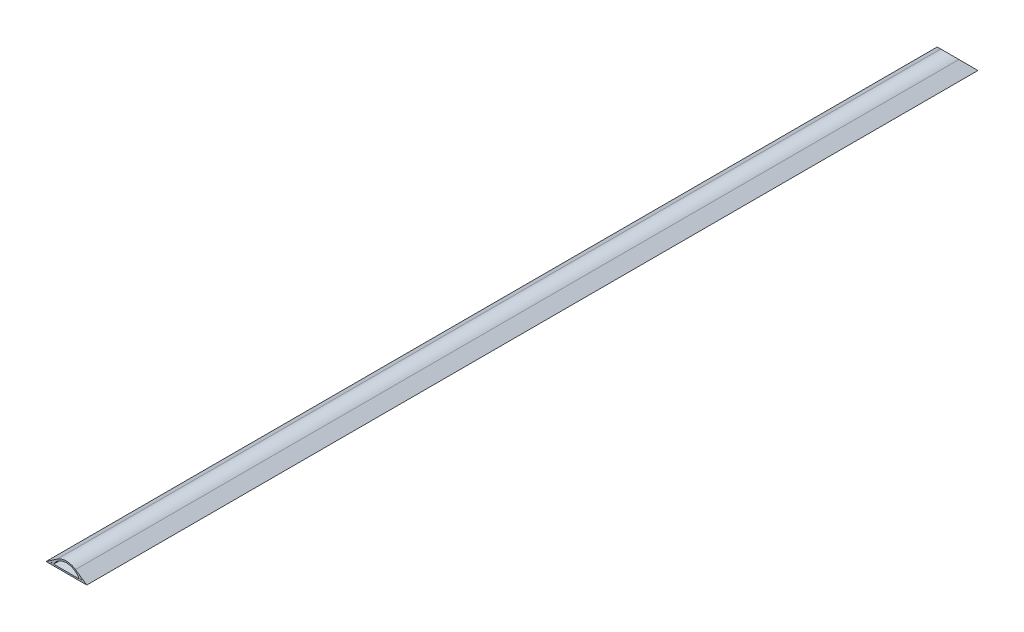
ISO-10303-21;
HEADER;
FILE_DESCRIPTION(('STEP AP214'),'2;1');
FILE_NAME('part.step','',(''),(''),'','','');
FILE_SCHEMA(('AUTOMOTIVE_DESIGN { 1 0 10303 214 1 1 1 1 }'));
ENDSEC;
DATA;
#1=APPLICATION_CONTEXT('core data for automotive mechanical design processes');
#2=APPLICATION_PROTOCOL_DEFINITION('international standard','automotive_design',2000,#1);
#3=PRODUCT_CONTEXT('',#1,'mechanical');
#4=PRODUCT('Part','Part','',(#3));
#5=PRODUCT_RELATED_PRODUCT_CATEGORY('part','',(#4));
#6=PRODUCT_DEFINITION_FORMATION('','',#4);
#7=PRODUCT_DEFINITION_CONTEXT('part definition',#1,'design');
#8=PRODUCT_DEFINITION('design','',#6,#7);
#9=PRODUCT_DEFINITION_SHAPE('','',#8);
#10=(LENGTH_UNIT() NAMED_UNIT(*) SI_UNIT(.MILLI.,.METRE.));
#11=(NAMED_UNIT(*) PLANE_ANGLE_UNIT() SI_UNIT($,.RADIAN.));
#12=(NAMED_UNIT(*) SI_UNIT($,.STERADIAN.) SOLID_ANGLE_UNIT());
#13=UNCERTAINTY_MEASURE_WITH_UNIT(LENGTH_MEASURE(1.E-05),#10,'distance_accuracy_value','');
#14=(GEOMETRIC_REPRESENTATION_CONTEXT(3) GLOBAL_UNCERTAINTY_ASSIGNED_CONTEXT((#13)) GLOBAL_UNIT_ASSIGNED_CONTEXT((#10,
#11,#12)) REPRESENTATION_CONTEXT('',''));
#15=CARTESIAN_POINT('',(0.,0.,0.));
#16=DIRECTION('',(0.,0.,1.));
#17=DIRECTION('',(1.,0.,0.));
#18=AXIS2_PLACEMENT_3D('',#15,#16,#17);
#19=CARTESIAN_POINT('',(34.29,-9.25285714285715,1498.6));
#20=DIRECTION('',(0.,0.,-1.));
#21=DIRECTION('',(-1.,0.,0.));
#22=AXIS2_PLACEMENT_3D('',#19,#20,#21);
#23=CYLINDRICAL_SURFACE('',#22,27.0328571428572);
#24=CARTESIAN_POINT('',(34.29,-9.25285714285715,-9.25285714285695));
#25=DIRECTION('',(0.,0.707106781186544,-0.707106781186551));
#26=DIRECTION('',(0.,-0.707106781186551,-0.707106781186544));
#27=AXIS2_PLACEMENT_3D('',#24,#25,#26);
#28=ELLIPSE('',#27,38.2302332011228,27.0328571428572);
#29=CARTESIAN_POINT('',(18.9926798567758,13.0354214300123,13.0354214300124));
#30=VERTEX_POINT('',#29);
#31=CARTESIAN_POINT('',(49.5873201432243,13.0354214300122,13.0354214300127));
#32=VERTEX_POINT('',#31);
#33=EDGE_CURVE('E54',#30,#32,#28,.T.);
#34=ORIENTED_EDGE('',*,*,#33,.F.);
#35=DIRECTION('',(0.,0.,-1.));
#36=VECTOR('',#35,1.);
#37=CARTESIAN_POINT('',(18.9926798567758,13.0354214300123,1498.6));
#38=LINE('',#37,#36);
#39=CARTESIAN_POINT('',(18.9926798567758,13.0354214300123,1498.6));
#40=VERTEX_POINT('',#39);
#41=EDGE_CURVE('E47',#40,#30,#38,.T.);
#42=ORIENTED_EDGE('',*,*,#41,.F.);
#43=CARTESIAN_POINT('',(34.29,-9.25285714285715,1498.6));
#44=DIRECTION('',(0.,0.,1.));
#45=DIRECTION('',(1.,0.,0.));
#46=AXIS2_PLACEMENT_3D('',#43,#44,#45);
#47=CIRCLE('',#46,27.0328571428572);
#48=CARTESIAN_POINT('',(49.5873201432242,13.0354214300123,1498.6));
#49=VERTEX_POINT('',#48);
#50=EDGE_CURVE('E157',#49,#40,#47,.T.);
#51=ORIENTED_EDGE('',*,*,#50,.F.);
#52=DIRECTION('',(0.,0.,-1.));
#53=VECTOR('',#52,1.);
#54=CARTESIAN_POINT('',(49.5873201432242,13.0354214300123,1498.6));
#55=LINE('',#54,#53);
#56=EDGE_CURVE('E163',#49,#32,#55,.T.);
#57=ORIENTED_EDGE('',*,*,#56,.T.);
#58=EDGE_LOOP('',(#34,#42,#51,#57));
#59=FACE_BOUND('',#58,.T.);
#60=ADVANCED_FACE('F40',(#59),#23,.T.);
#61=CARTESIAN_POINT('',(18.9926798567758,13.0354214300123,1498.6));
#62=DIRECTION('',(0.565878777163079,-0.824488453258394,0.));
#63=DIRECTION('',(0.824488453258394,0.565878777163079,0.));
#64=AXIS2_PLACEMENT_3D('',#61,#62,#63);
#65=PLANE('',#64);
#66=DIRECTION('',(0.717565620621447,0.492493441632557,0.492493441632552));
#67=VECTOR('',#66,1.);
#68=CARTESIAN_POINT('',(543.985797583654,373.358798069482,373.358798069479));
#69=LINE('',#68,#67);
#70=CARTESIAN_POINT('',(0.,0.,0.));
#71=VERTEX_POINT('',#70);
#72=EDGE_CURVE('E177',#71,#30,#69,.T.);
#73=ORIENTED_EDGE('',*,*,#72,.F.);
#74=DIRECTION('',(0.,0.,-1.));
#75=VECTOR('',#74,1.);
#76=CARTESIAN_POINT('',(0.,0.,1498.6));
#77=LINE('',#76,#75);
#78=CARTESIAN_POINT('',(0.,0.,1498.6));
#79=VERTEX_POINT('',#78);
#80=EDGE_CURVE('E156',#79,#71,#77,.T.);
#81=ORIENTED_EDGE('',*,*,#80,.F.);
#82=DIRECTION('',(-0.824488453258394,-0.565878777163079,0.));
#83=VECTOR('',#82,1.);
#84=CARTESIAN_POINT('',(18.9926798567758,13.0354214300123,1498.6));
#85=LINE('',#84,#83);
#86=EDGE_CURVE('E178',#40,#79,#85,.T.);
#87=ORIENTED_EDGE('',*,*,#86,.F.);
#88=ORIENTED_EDGE('',*,*,#41,.T.);
#89=EDGE_LOOP('',(#73,#81,#87,#88));
#90=FACE_BOUND('',#89,.T.);
#91=ADVANCED_FACE('F176',(#90),#65,.F.);
#92=CARTESIAN_POINT('',(49.5873201432242,13.0354214300123,1498.6));
#93=DIRECTION('',(-0.565878777163079,-0.824488453258394,0.));
#94=DIRECTION('',(0.824488453258394,-0.565878777163079,0.));
#95=AXIS2_PLACEMENT_3D('',#92,#93,#94);
#96=PLANE('',#95);
#97=DIRECTION('',(0.717565620621447,-0.492493441632557,-0.492493441632552));
#98=VECTOR('',#97,1.);
#99=CARTESIAN_POINT('',(-475.405797583654,373.358798069482,373.358798069479));
#100=LINE('',#99,#98);
#101=CARTESIAN_POINT('',(68.58,0.,0.));
#102=VERTEX_POINT('',#101);
#103=EDGE_CURVE('E137',#32,#102,#100,.T.);
#104=ORIENTED_EDGE('',*,*,#103,.F.);
#105=ORIENTED_EDGE('',*,*,#56,.F.);
#106=DIRECTION('',(-0.824488453258394,0.565878777163079,0.));
#107=VECTOR('',#106,1.);
#108=CARTESIAN_POINT('',(49.5873201432242,13.0354214300123,1498.6));
#109=LINE('',#108,#107);
#110=CARTESIAN_POINT('',(68.58,0.,1498.6));
#111=VERTEX_POINT('',#110);
#112=EDGE_CURVE('E161',#111,#49,#109,.T.);
#113=ORIENTED_EDGE('',*,*,#112,.F.);
#114=DIRECTION('',(0.,0.,-1.));
#115=VECTOR('',#114,1.);
#116=CARTESIAN_POINT('',(68.58,0.,1498.6));
#117=LINE('',#116,#115);
#118=EDGE_CURVE('E153',#111,#102,#117,.T.);
#119=ORIENTED_EDGE('',*,*,#118,.T.);
#120=EDGE_LOOP('',(#104,#105,#113,#119));
#121=FACE_BOUND('',#120,.T.);
#122=ADVANCED_FACE('F160',(#121),#96,.F.);
#123=CARTESIAN_POINT('',(8.18938765385225,2.54,1498.6));
#124=DIRECTION('',(0.,1.,0.));
#125=DIRECTION('',(-1.,0.,0.));
#126=AXIS2_PLACEMENT_3D('',#123,#124,#125);
#127=PLANE('',#126);
#128=DIRECTION('',(0.,0.,-1.));
#129=VECTOR('',#128,1.);
#130=CARTESIAN_POINT('',(9.9650357510173,2.54,1498.6));
#131=LINE('',#130,#129);
#132=CARTESIAN_POINT('',(9.9650357510173,2.54,1498.6));
#133=VERTEX_POINT('',#132);
#134=CARTESIAN_POINT('',(9.9650357510173,2.54,2.54000000000021));
#135=VERTEX_POINT('',#134);
#136=EDGE_CURVE('E158',#133,#135,#131,.T.);
#137=ORIENTED_EDGE('',*,*,#136,.T.);
#138=DIRECTION('',(-1.,0.,0.));
#139=VECTOR('',#138,1.);
#140=CARTESIAN_POINT('',(8.18938765385261,2.54,2.54000000000021));
#141=LINE('',#140,#139);
#142=CARTESIAN_POINT('',(8.18938765385224,2.53999999999993,2.53999999999993));
#143=VERTEX_POINT('',#142);
#144=EDGE_CURVE('E146',#135,#143,#141,.T.);
#145=ORIENTED_EDGE('',*,*,#144,.T.);
#146=DIRECTION('',(0.,0.,-1.));
#147=VECTOR('',#146,1.);
#148=CARTESIAN_POINT('',(8.18938765385225,2.54,1498.6));
#149=LINE('',#148,#147);
#150=CARTESIAN_POINT('',(8.18938765385225,2.54,1498.6));
#151=VERTEX_POINT('',#150);
#152=EDGE_CURVE('E230',#151,#143,#149,.T.);
#153=ORIENTED_EDGE('',*,*,#152,.F.);
#154=DIRECTION('',(1.,0.,0.));
#155=VECTOR('',#154,1.);
#156=CARTESIAN_POINT('',(8.18938765385225,2.54,1498.6));
#157=LINE('',#156,#155);
#158=EDGE_CURVE('E221',#151,#133,#157,.T.);
#159=ORIENTED_EDGE('',*,*,#158,.T.);
#160=EDGE_LOOP('',(#137,#145,#153,#159));
#161=FACE_BOUND('',#160,.T.);
#162=ADVANCED_FACE('F288',(#161),#127,.T.);
#163=CARTESIAN_POINT('',(34.29,-9.25285714285715,1498.6));
#164=DIRECTION('',(0.,0.,-1.));
#165=DIRECTION('',(-1.,0.,0.));
#166=AXIS2_PLACEMENT_3D('',#163,#164,#165);
#167=CYLINDRICAL_SURFACE('',#166,27.0328571428572);
#168=DIRECTION('',(0.,0.,-1.));
#169=VECTOR('',#168,1.);
#170=CARTESIAN_POINT('',(10.9978022708371,4.46752514961934,1498.6));
#171=LINE('',#170,#169);
#172=CARTESIAN_POINT('',(10.9978022708371,4.46752514961934,1498.6));
#173=VERTEX_POINT('',#172);
#174=CARTESIAN_POINT('',(10.9978022708371,4.46752514961929,4.46752514961918));
#175=VERTEX_POINT('',#174);
#176=EDGE_CURVE('E234',#173,#175,#171,.T.);
#177=ORIENTED_EDGE('',*,*,#176,.T.);
#178=CARTESIAN_POINT('',(34.29,-9.25285714285715,-9.25285714285695));
#179=DIRECTION('',(0.,0.707106781186544,-0.707106781186551));
#180=DIRECTION('',(0.,-0.707106781186551,-0.707106781186544));
#181=AXIS2_PLACEMENT_3D('',#178,#179,#180);
#182=ELLIPSE('',#181,38.2302332011228,27.0328571428572);
#183=EDGE_CURVE('E62',#175,#135,#182,.F.);
#184=ORIENTED_EDGE('',*,*,#183,.T.);
#185=ORIENTED_EDGE('',*,*,#136,.F.);
#186=CARTESIAN_POINT('',(34.29,-9.25285714285715,1498.6));
#187=DIRECTION('',(0.,0.,-1.));
#188=DIRECTION('',(1.,0.,0.));
#189=AXIS2_PLACEMENT_3D('',#186,#187,#188);
#190=CIRCLE('',#189,27.0328571428572);
#191=EDGE_CURVE('E224',#133,#173,#190,.T.);
#192=ORIENTED_EDGE('',*,*,#191,.T.);
#193=EDGE_LOOP('',(#177,#184,#185,#192));
#194=FACE_BOUND('',#193,.T.);
#195=ADVANCED_FACE('F293',(#194),#167,.T.);
#196=CARTESIAN_POINT('',(10.9978022708371,4.46752514961934,1498.6));
#197=DIRECTION('',(0.565878777163076,-0.824488453258395,0.));
#198=DIRECTION('',(0.824488453258396,0.565878777163077,0.));
#199=AXIS2_PLACEMENT_3D('',#196,#197,#198);
#200=PLANE('',#199);
#201=ORIENTED_EDGE('',*,*,#152,.T.);
#202=DIRECTION('',(0.717565620621449,0.492493441632556,0.492493441632551));
#203=VECTOR('',#202,1.);
#204=CARTESIAN_POINT('',(539.018783374031,366.869043233075,366.869043233072));
#205=LINE('',#204,#203);
#206=EDGE_CURVE('E283',#143,#175,#205,.T.);
#207=ORIENTED_EDGE('',*,*,#206,.T.);
#208=ORIENTED_EDGE('',*,*,#176,.F.);
#209=DIRECTION('',(-0.824488453258395,-0.565878777163076,0.));
#210=VECTOR('',#209,1.);
#211=CARTESIAN_POINT('',(10.9978022708371,4.46752514961934,1498.6));
#212=LINE('',#211,#210);
#213=EDGE_CURVE('E228',#173,#151,#212,.T.);
#214=ORIENTED_EDGE('',*,*,#213,.T.);
#215=EDGE_LOOP('',(#201,#207,#208,#214));
#216=FACE_BOUND('',#215,.T.);
#217=ADVANCED_FACE('F291',(#216),#200,.T.);
#218=CARTESIAN_POINT('',(58.6149642489827,2.54,1498.6));
#219=DIRECTION('',(0.,1.,0.));
#220=DIRECTION('',(-1.,0.,0.));
#221=AXIS2_PLACEMENT_3D('',#218,#219,#220);
#222=PLANE('',#221);
#223=DIRECTION('',(0.,0.,-1.));
#224=VECTOR('',#223,1.);
#225=CARTESIAN_POINT('',(60.3906123461478,2.54,1498.6));
#226=LINE('',#225,#224);
#227=CARTESIAN_POINT('',(60.3906123461478,2.54,1498.6));
#228=VERTEX_POINT('',#227);
#229=CARTESIAN_POINT('',(60.3906123461477,2.53999999999999,2.54000000000015));
#230=VERTEX_POINT('',#229);
#231=EDGE_CURVE('E218',#228,#230,#226,.T.);
#232=ORIENTED_EDGE('',*,*,#231,.T.);
#233=DIRECTION('',(-1.,0.,0.));
#234=VECTOR('',#233,1.);
#235=CARTESIAN_POINT('',(58.614964248982,2.54,2.54000000000021));
#236=LINE('',#235,#234);
#237=CARTESIAN_POINT('',(58.6149642489827,2.54,2.54000000000021));
#238=VERTEX_POINT('',#237);
#239=EDGE_CURVE('E280',#230,#238,#236,.T.);
#240=ORIENTED_EDGE('',*,*,#239,.T.);
#241=DIRECTION('',(0.,0.,-1.));
#242=VECTOR('',#241,1.);
#243=CARTESIAN_POINT('',(58.6149642489827,2.54,1498.6));
#244=LINE('',#243,#242);
#245=CARTESIAN_POINT('',(58.6149642489827,2.54,1498.6));
#246=VERTEX_POINT('',#245);
#247=EDGE_CURVE('E210',#246,#238,#244,.T.);
#248=ORIENTED_EDGE('',*,*,#247,.F.);
#249=DIRECTION('',(1.,0.,0.));
#250=VECTOR('',#249,1.);
#251=CARTESIAN_POINT('',(58.6149642489827,2.54,1498.6));
#252=LINE('',#251,#250);
#253=EDGE_CURVE('E200',#246,#228,#252,.T.);
#254=ORIENTED_EDGE('',*,*,#253,.T.);
#255=EDGE_LOOP('',(#232,#240,#248,#254));
#256=FACE_BOUND('',#255,.T.);
#257=ADVANCED_FACE('F300',(#256),#222,.T.);
#258=CARTESIAN_POINT('',(57.5821977291629,4.46752514961935,1498.6));
#259=DIRECTION('',(-0.565878777163076,-0.824488453258395,0.));
#260=DIRECTION('',(0.824488453258396,-0.565878777163076,0.));
#261=AXIS2_PLACEMENT_3D('',#258,#259,#260);
#262=PLANE('',#261);
#263=DIRECTION('',(0.,0.,-1.));
#264=VECTOR('',#263,1.);
#265=CARTESIAN_POINT('',(57.5821977291629,4.46752514961935,1498.6));
#266=LINE('',#265,#264);
#267=CARTESIAN_POINT('',(57.5821977291629,4.46752514961936,1498.6));
#268=VERTEX_POINT('',#267);
#269=CARTESIAN_POINT('',(57.5821977291629,4.46752514961935,4.46752514961934));
#270=VERTEX_POINT('',#269);
#271=EDGE_CURVE('E214',#268,#270,#266,.T.);
#272=ORIENTED_EDGE('',*,*,#271,.T.);
#273=DIRECTION('',(0.717565620621449,-0.492493441632556,-0.492493441632551));
#274=VECTOR('',#273,1.);
#275=CARTESIAN_POINT('',(-470.438783374031,366.869043233075,366.869043233072));
#276=LINE('',#275,#274);
#277=EDGE_CURVE('E275',#270,#230,#276,.T.);
#278=ORIENTED_EDGE('',*,*,#277,.T.);
#279=ORIENTED_EDGE('',*,*,#231,.F.);
#280=DIRECTION('',(-0.824488453258395,0.565878777163076,0.));
#281=VECTOR('',#280,1.);
#282=CARTESIAN_POINT('',(57.5821977291629,4.46752514961935,1498.6));
#283=LINE('',#282,#281);
#284=EDGE_CURVE('E203',#228,#268,#283,.T.);
#285=ORIENTED_EDGE('',*,*,#284,.T.);
#286=EDGE_LOOP('',(#272,#278,#279,#285));
#287=FACE_BOUND('',#286,.T.);
#288=ADVANCED_FACE('F328',(#287),#262,.T.);
#289=CARTESIAN_POINT('',(34.29,-9.25285714285715,1498.6));
#290=DIRECTION('',(0.,0.,-1.));
#291=DIRECTION('',(-1.,0.,0.));
#292=AXIS2_PLACEMENT_3D('',#289,#290,#291);
#293=CYLINDRICAL_SURFACE('',#292,27.0328571428572);
#294=ORIENTED_EDGE('',*,*,#247,.T.);
#295=CARTESIAN_POINT('',(34.29,-9.25285714285715,-9.25285714285695));
#296=DIRECTION('',(0.,0.707106781186544,-0.707106781186551));
#297=DIRECTION('',(0.,-0.707106781186551,-0.707106781186544));
#298=AXIS2_PLACEMENT_3D('',#295,#296,#297);
#299=ELLIPSE('',#298,38.2302332011228,27.0328571428572);
#300=EDGE_CURVE('E272',#238,#270,#299,.F.);
#301=ORIENTED_EDGE('',*,*,#300,.T.);
#302=ORIENTED_EDGE('',*,*,#271,.F.);
#303=CARTESIAN_POINT('',(34.29,-9.25285714285715,1498.6));
#304=DIRECTION('',(0.,0.,-1.));
#305=DIRECTION('',(1.,0.,0.));
#306=AXIS2_PLACEMENT_3D('',#303,#304,#305);
#307=CIRCLE('',#306,27.0328571428572);
#308=EDGE_CURVE('E207',#268,#246,#307,.T.);
#309=ORIENTED_EDGE('',*,*,#308,.T.);
#310=EDGE_LOOP('',(#294,#301,#302,#309));
#311=FACE_BOUND('',#310,.T.);
#312=ADVANCED_FACE('F325',(#311),#293,.T.);
#313=CARTESIAN_POINT('',(34.29,-9.25285714285715,1498.6));
#314=DIRECTION('',(0.,0.,-1.));
#315=DIRECTION('',(-1.,0.,0.));
#316=AXIS2_PLACEMENT_3D('',#313,#314,#315);
#317=CYLINDRICAL_SURFACE('',#316,24.4928571428572);
#318=DIRECTION('',(0.,0.,-1.));
#319=VECTOR('',#318,1.);
#320=CARTESIAN_POINT('',(12.8230819298957,2.54,1498.6));
#321=LINE('',#320,#319);
#322=CARTESIAN_POINT('',(12.8230819298957,2.54,1498.6));
#323=VERTEX_POINT('',#322);
#324=CARTESIAN_POINT('',(12.8230819298957,2.54,2.54000000000065));
#325=VERTEX_POINT('',#324);
#326=EDGE_CURVE('E197',#323,#325,#321,.T.);
#327=ORIENTED_EDGE('',*,*,#326,.T.);
#328=CARTESIAN_POINT('',(34.29,-9.25285714285715,-9.25285714285695));
#329=DIRECTION('',(0.,0.707106781186544,-0.707106781186551));
#330=DIRECTION('',(0.,-0.707106781186551,-0.707106781186544));
#331=AXIS2_PLACEMENT_3D('',#328,#329,#330);
#332=ELLIPSE('',#331,34.6381307526951,24.4928571428572);
#333=CARTESIAN_POINT('',(55.7569180701043,2.54,2.54000000000021));
#334=VERTEX_POINT('',#333);
#335=EDGE_CURVE('E270',#325,#334,#332,.T.);
#336=ORIENTED_EDGE('',*,*,#335,.T.);
#337=DIRECTION('',(0.,0.,-1.));
#338=VECTOR('',#337,1.);
#339=CARTESIAN_POINT('',(55.7569180701043,2.54,1498.6));
#340=LINE('',#339,#338);
#341=CARTESIAN_POINT('',(55.7569180701043,2.54,1498.6));
#342=VERTEX_POINT('',#341);
#343=EDGE_CURVE('E193',#342,#334,#340,.T.);
#344=ORIENTED_EDGE('',*,*,#343,.F.);
#345=CARTESIAN_POINT('',(34.29,-9.25285714285715,1498.6));
#346=DIRECTION('',(0.,0.,1.));
#347=DIRECTION('',(1.,0.,0.));
#348=AXIS2_PLACEMENT_3D('',#345,#346,#347);
#349=CIRCLE('',#348,24.4928571428572);
#350=EDGE_CURVE('E183',#342,#323,#349,.T.);
#351=ORIENTED_EDGE('',*,*,#350,.T.);
#352=EDGE_LOOP('',(#327,#336,#344,#351));
#353=FACE_BOUND('',#352,.T.);
#354=ADVANCED_FACE('F269',(#353),#317,.F.);
#355=CARTESIAN_POINT('',(12.8230819298957,2.54,1498.6));
#356=DIRECTION('',(0.,1.,0.));
#357=DIRECTION('',(0.,0.,1.));
#358=AXIS2_PLACEMENT_3D('',#355,#356,#357);
#359=PLANE('',#358);
#360=ORIENTED_EDGE('',*,*,#343,.T.);
#361=DIRECTION('',(-1.,0.,0.));
#362=VECTOR('',#361,1.);
#363=CARTESIAN_POINT('',(12.8230819298957,2.54,2.54000000000021));
#364=LINE('',#363,#362);
#365=EDGE_CURVE('E11',#334,#325,#364,.T.);
#366=ORIENTED_EDGE('',*,*,#365,.T.);
#367=ORIENTED_EDGE('',*,*,#326,.F.);
#368=DIRECTION('',(1.,0.,0.));
#369=VECTOR('',#368,1.);
#370=CARTESIAN_POINT('',(12.8230819298957,2.54,1498.6));
#371=LINE('',#370,#369);
#372=EDGE_CURVE('E190',#323,#342,#371,.T.);
#373=ORIENTED_EDGE('',*,*,#372,.T.);
#374=EDGE_LOOP('',(#360,#366,#367,#373));
#375=FACE_BOUND('',#374,.T.);
#376=ADVANCED_FACE('F253',(#375),#359,.T.);
#377=CARTESIAN_POINT('',(34.29,-9.25285714285715,1498.6));
#378=DIRECTION('',(0.,0.,1.));
#379=DIRECTION('',(1.,0.,0.));
#380=AXIS2_PLACEMENT_3D('',#377,#378,#379);
#381=PLANE('',#380);
#382=ORIENTED_EDGE('',*,*,#50,.T.);
#383=ORIENTED_EDGE('',*,*,#86,.T.);
#384=DIRECTION('',(1.,0.,0.));
#385=VECTOR('',#384,1.);
#386=CARTESIAN_POINT('',(0.,0.,1498.6));
#387=LINE('',#386,#385);
#388=EDGE_CURVE('E245',#79,#111,#387,.T.);
#389=ORIENTED_EDGE('',*,*,#388,.T.);
#390=ORIENTED_EDGE('',*,*,#112,.T.);
#391=EDGE_LOOP('',(#382,#383,#389,#390));
#392=FACE_BOUND('',#391,.T.);
#393=ORIENTED_EDGE('',*,*,#191,.F.);
#394=ORIENTED_EDGE('',*,*,#158,.F.);
#395=ORIENTED_EDGE('',*,*,#213,.F.);
#396=EDGE_LOOP('',(#393,#394,#395));
#397=FACE_BOUND('',#396,.T.);
#398=ORIENTED_EDGE('',*,*,#284,.F.);
#399=ORIENTED_EDGE('',*,*,#253,.F.);
#400=ORIENTED_EDGE('',*,*,#308,.F.);
#401=EDGE_LOOP('',(#398,#399,#400));
#402=FACE_BOUND('',#401,.T.);
#403=ORIENTED_EDGE('',*,*,#372,.F.);
#404=ORIENTED_EDGE('',*,*,#350,.F.);
#405=EDGE_LOOP('',(#403,#404));
#406=FACE_BOUND('',#405,.T.);
#407=ADVANCED_FACE('F250',(#392,#397,#402,#406),#381,.T.);
#408=CARTESIAN_POINT('',(0.,0.,1498.6));
#409=DIRECTION('',(0.,1.,0.));
#410=DIRECTION('',(0.,0.,1.));
#411=AXIS2_PLACEMENT_3D('',#408,#409,#410);
#412=PLANE('',#411);
#413=DIRECTION('',(1.,0.,0.));
#414=VECTOR('',#413,1.);
#415=CARTESIAN_POINT('',(0.,0.,0.));
#416=LINE('',#415,#414);
#417=EDGE_CURVE('E140',#71,#102,#416,.T.);
#418=ORIENTED_EDGE('',*,*,#417,.T.);
#419=ORIENTED_EDGE('',*,*,#118,.F.);
#420=ORIENTED_EDGE('',*,*,#388,.F.);
#421=ORIENTED_EDGE('',*,*,#80,.T.);
#422=EDGE_LOOP('',(#418,#419,#420,#421));
#423=FACE_BOUND('',#422,.T.);
#424=ADVANCED_FACE('F151',(#423),#412,.F.);
#425=CARTESIAN_POINT('',(68.58,17.78,17.7799999999998));
#426=DIRECTION('',(0.,0.707106781186544,-0.707106781186551));
#427=DIRECTION('',(0.,0.707106781186551,0.707106781186544));
#428=AXIS2_PLACEMENT_3D('',#425,#426,#427);
#429=PLANE('',#428);
#430=ORIENTED_EDGE('',*,*,#183,.F.);
#431=ORIENTED_EDGE('',*,*,#206,.F.);
#432=ORIENTED_EDGE('',*,*,#144,.F.);
#433=EDGE_LOOP('',(#430,#431,#432));
#434=FACE_BOUND('',#433,.T.);
#435=ORIENTED_EDGE('',*,*,#277,.F.);
#436=ORIENTED_EDGE('',*,*,#300,.F.);
#437=ORIENTED_EDGE('',*,*,#239,.F.);
#438=EDGE_LOOP('',(#435,#436,#437));
#439=FACE_BOUND('',#438,.T.);
#440=ORIENTED_EDGE('',*,*,#365,.F.);
#441=ORIENTED_EDGE('',*,*,#335,.F.);
#442=EDGE_LOOP('',(#440,#441));
#443=FACE_BOUND('',#442,.T.);
#444=ORIENTED_EDGE('',*,*,#72,.T.);
#445=ORIENTED_EDGE('',*,*,#33,.T.);
#446=ORIENTED_EDGE('',*,*,#103,.T.);
#447=ORIENTED_EDGE('',*,*,#417,.F.);
#448=EDGE_LOOP('',(#444,#445,#446,#447));
#449=FACE_BOUND('',#448,.T.);
#450=ADVANCED_FACE('F139',(#434,#439,#443,#449),#429,.T.);
#451=CLOSED_SHELL('',(#60,#91,#122,#162,#195,#217,#257,#288,#312,#354,#376,#407,#424,#450));
#452=MANIFOLD_SOLID_BREP('B2',#451);
#453=ADVANCED_BREP_SHAPE_REPRESENTATION('',(#18,#452),#14);
#454=SHAPE_DEFINITION_REPRESENTATION(#9,#453);
ENDSEC;
END-ISO-10303-21;
